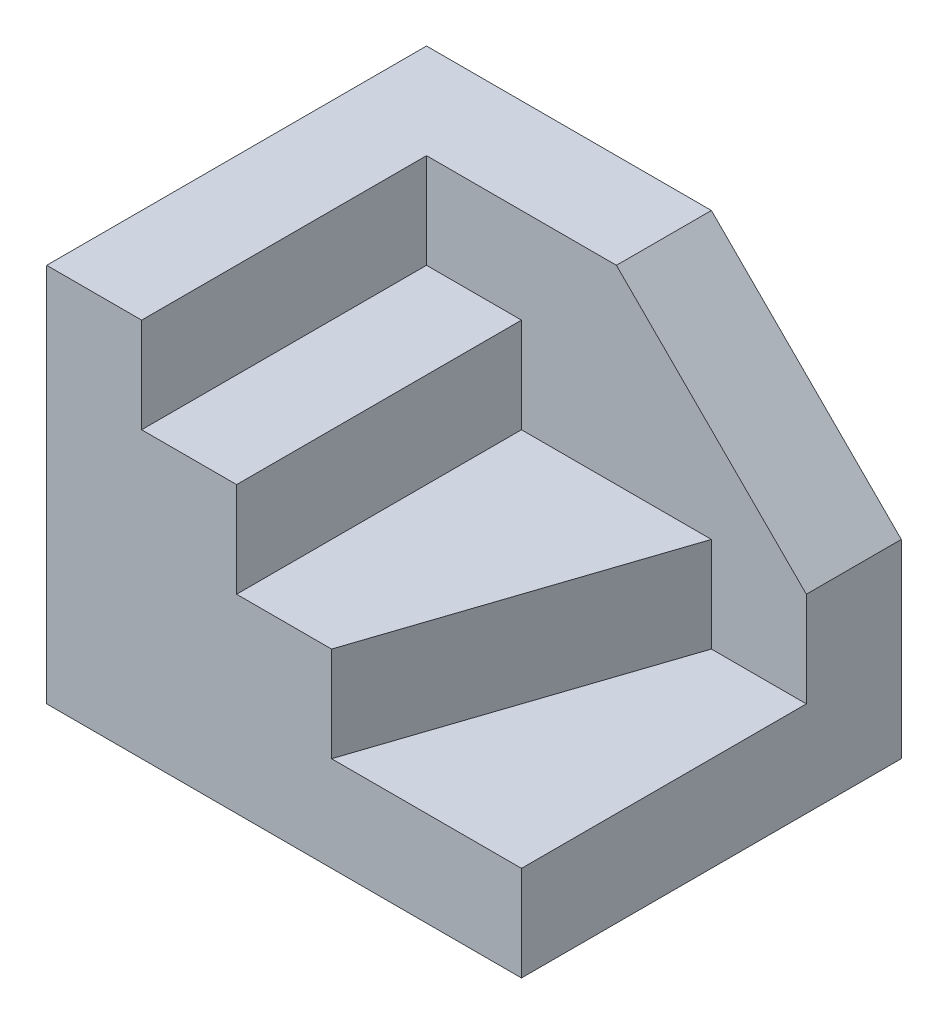
ISO-10303-21;
HEADER;
FILE_DESCRIPTION(('STEP AP214'),'2;1');
FILE_NAME('part.step','',(''),(''),'','','');
FILE_SCHEMA(('AUTOMOTIVE_DESIGN { 1 0 10303 214 1 1 1 1 }'));
ENDSEC;
DATA;
#1=APPLICATION_CONTEXT('core data for automotive mechanical design processes');
#2=APPLICATION_PROTOCOL_DEFINITION('international standard','automotive_design',2000,#1);
#3=PRODUCT_CONTEXT('',#1,'mechanical');
#4=PRODUCT('Part','Part','',(#3));
#5=PRODUCT_RELATED_PRODUCT_CATEGORY('part','',(#4));
#6=PRODUCT_DEFINITION_FORMATION('','',#4);
#7=PRODUCT_DEFINITION_CONTEXT('part definition',#1,'design');
#8=PRODUCT_DEFINITION('design','',#6,#7);
#9=PRODUCT_DEFINITION_SHAPE('','',#8);
#10=(LENGTH_UNIT() NAMED_UNIT(*) SI_UNIT(.MILLI.,.METRE.));
#11=(NAMED_UNIT(*) PLANE_ANGLE_UNIT() SI_UNIT($,.RADIAN.));
#12=(NAMED_UNIT(*) SI_UNIT($,.STERADIAN.) SOLID_ANGLE_UNIT());
#13=UNCERTAINTY_MEASURE_WITH_UNIT(LENGTH_MEASURE(1.E-05),#10,'distance_accuracy_value','');
#14=(GEOMETRIC_REPRESENTATION_CONTEXT(3) GLOBAL_UNCERTAINTY_ASSIGNED_CONTEXT((#13)) GLOBAL_UNIT_ASSIGNED_CONTEXT((#10,
#11,#12)) REPRESENTATION_CONTEXT('',''));
#15=CARTESIAN_POINT('',(0.,0.,0.));
#16=DIRECTION('',(0.,0.,1.));
#17=DIRECTION('',(1.,0.,0.));
#18=AXIS2_PLACEMENT_3D('',#15,#16,#17);
#19=CARTESIAN_POINT('',(0.,5.,0.));
#20=DIRECTION('',(0.,1.,0.));
#21=DIRECTION('',(0.,0.,1.));
#22=AXIS2_PLACEMENT_3D('',#19,#20,#21);
#23=PLANE('',#22);
#24=DIRECTION('',(1.,0.,0.));
#25=VECTOR('',#24,1.);
#26=CARTESIAN_POINT('',(0.,5.,-5.));
#27=LINE('',#26,#25);
#28=CARTESIAN_POINT('',(7.5,5.,-5.));
#29=VERTEX_POINT('',#28);
#30=CARTESIAN_POINT('',(12.5,5.,-5.));
#31=VERTEX_POINT('',#30);
#32=EDGE_CURVE('E156',#29,#31,#27,.T.);
#33=ORIENTED_EDGE('',*,*,#32,.F.);
#34=DIRECTION('',(0.316227766016838,0.,-0.948683298050514));
#35=VECTOR('',#34,1.);
#36=CARTESIAN_POINT('',(5.25,5.,1.75));
#37=LINE('',#36,#35);
#38=CARTESIAN_POINT('',(2.5,5.,10.));
#39=VERTEX_POINT('',#38);
#40=EDGE_CURVE('E114',#39,#29,#37,.T.);
#41=ORIENTED_EDGE('',*,*,#40,.F.);
#42=DIRECTION('',(-1.,0.,0.));
#43=VECTOR('',#42,1.);
#44=CARTESIAN_POINT('',(0.,5.,10.));
#45=LINE('',#44,#43);
#46=CARTESIAN_POINT('',(12.5,5.,10.));
#47=VERTEX_POINT('',#46);
#48=EDGE_CURVE('E101',#47,#39,#45,.T.);
#49=ORIENTED_EDGE('',*,*,#48,.F.);
#50=DIRECTION('',(0.,0.,-1.));
#51=VECTOR('',#50,1.);
#52=CARTESIAN_POINT('',(12.5,5.,0.));
#53=LINE('',#52,#51);
#54=EDGE_CURVE('E103',#47,#31,#53,.T.);
#55=ORIENTED_EDGE('',*,*,#54,.T.);
#56=EDGE_LOOP('',(#33,#41,#49,#55));
#57=FACE_BOUND('',#56,.T.);
#58=ADVANCED_FACE('F35',(#57),#23,.T.);
#59=CARTESIAN_POINT('',(0.,5.,10.));
#60=DIRECTION('',(0.,0.,1.));
#61=DIRECTION('',(1.,0.,0.));
#62=AXIS2_PLACEMENT_3D('',#59,#60,#61);
#63=PLANE('',#62);
#64=DIRECTION('',(-1.,0.,0.));
#65=VECTOR('',#64,1.);
#66=CARTESIAN_POINT('',(0.,20.,10.));
#67=LINE('',#66,#65);
#68=CARTESIAN_POINT('',(-7.5,20.,10.));
#69=VERTEX_POINT('',#68);
#70=CARTESIAN_POINT('',(-12.5,20.,10.));
#71=VERTEX_POINT('',#70);
#72=EDGE_CURVE('E167',#69,#71,#67,.T.);
#73=ORIENTED_EDGE('',*,*,#72,.T.);
#74=DIRECTION('',(0.,-1.,0.));
#75=VECTOR('',#74,1.);
#76=CARTESIAN_POINT('',(-12.5,5.,10.));
#77=LINE('',#76,#75);
#78=CARTESIAN_POINT('',(-12.5,0.,10.));
#79=VERTEX_POINT('',#78);
#80=EDGE_CURVE('E87',#71,#79,#77,.T.);
#81=ORIENTED_EDGE('',*,*,#80,.T.);
#82=DIRECTION('',(-1.,0.,0.));
#83=VECTOR('',#82,1.);
#84=CARTESIAN_POINT('',(0.,0.,10.));
#85=LINE('',#84,#83);
#86=CARTESIAN_POINT('',(12.5,0.,10.));
#87=VERTEX_POINT('',#86);
#88=EDGE_CURVE('E99',#87,#79,#85,.T.);
#89=ORIENTED_EDGE('',*,*,#88,.F.);
#90=DIRECTION('',(0.,-1.,0.));
#91=VECTOR('',#90,1.);
#92=CARTESIAN_POINT('',(12.5,5.,10.));
#93=LINE('',#92,#91);
#94=EDGE_CURVE('E43',#47,#87,#93,.T.);
#95=ORIENTED_EDGE('',*,*,#94,.F.);
#96=ORIENTED_EDGE('',*,*,#48,.T.);
#97=DIRECTION('',(0.,-1.,0.));
#98=VECTOR('',#97,1.);
#99=CARTESIAN_POINT('',(2.5,10.,10.));
#100=LINE('',#99,#98);
#101=CARTESIAN_POINT('',(2.5,10.,10.));
#102=VERTEX_POINT('',#101);
#103=EDGE_CURVE('E123',#102,#39,#100,.T.);
#104=ORIENTED_EDGE('',*,*,#103,.F.);
#105=DIRECTION('',(-1.,0.,0.));
#106=VECTOR('',#105,1.);
#107=CARTESIAN_POINT('',(0.,10.,10.));
#108=LINE('',#107,#106);
#109=CARTESIAN_POINT('',(-2.5,10.,10.));
#110=VERTEX_POINT('',#109);
#111=EDGE_CURVE('E126',#102,#110,#108,.T.);
#112=ORIENTED_EDGE('',*,*,#111,.T.);
#113=DIRECTION('',(0.,-1.,0.));
#114=VECTOR('',#113,1.);
#115=CARTESIAN_POINT('',(-2.5,15.,10.));
#116=LINE('',#115,#114);
#117=CARTESIAN_POINT('',(-2.5,15.,10.));
#118=VERTEX_POINT('',#117);
#119=EDGE_CURVE('E138',#118,#110,#116,.T.);
#120=ORIENTED_EDGE('',*,*,#119,.F.);
#121=DIRECTION('',(-1.,0.,0.));
#122=VECTOR('',#121,1.);
#123=CARTESIAN_POINT('',(0.,15.,10.));
#124=LINE('',#123,#122);
#125=CARTESIAN_POINT('',(-7.5,15.,10.));
#126=VERTEX_POINT('',#125);
#127=EDGE_CURVE('E153',#118,#126,#124,.T.);
#128=ORIENTED_EDGE('',*,*,#127,.T.);
#129=DIRECTION('',(0.,-1.,0.));
#130=VECTOR('',#129,1.);
#131=CARTESIAN_POINT('',(-7.5,20.,10.));
#132=LINE('',#131,#130);
#133=EDGE_CURVE('E164',#69,#126,#132,.T.);
#134=ORIENTED_EDGE('',*,*,#133,.F.);
#135=EDGE_LOOP('',(#73,#81,#89,#95,#96,#104,#112,#120,#128,#134));
#136=FACE_BOUND('',#135,.T.);
#137=ADVANCED_FACE('F37',(#136),#63,.T.);
#138=CARTESIAN_POINT('',(12.5,5.,0.));
#139=DIRECTION('',(-1.,0.,0.));
#140=DIRECTION('',(0.,0.,1.));
#141=AXIS2_PLACEMENT_3D('',#138,#139,#140);
#142=PLANE('',#141);
#143=DIRECTION('',(0.,-1.,0.));
#144=VECTOR('',#143,1.);
#145=CARTESIAN_POINT('',(12.5,5.,-10.));
#146=LINE('',#145,#144);
#147=CARTESIAN_POINT('',(12.5,10.,-10.));
#148=VERTEX_POINT('',#147);
#149=CARTESIAN_POINT('',(12.5,0.,-10.));
#150=VERTEX_POINT('',#149);
#151=EDGE_CURVE('E86',#148,#150,#146,.T.);
#152=ORIENTED_EDGE('',*,*,#151,.F.);
#153=DIRECTION('',(0.,0.,1.));
#154=VECTOR('',#153,1.);
#155=CARTESIAN_POINT('',(12.5,10.,-25.));
#156=LINE('',#155,#154);
#157=CARTESIAN_POINT('',(12.5,10.,-5.));
#158=VERTEX_POINT('',#157);
#159=EDGE_CURVE('E180',#148,#158,#156,.T.);
#160=ORIENTED_EDGE('',*,*,#159,.T.);
#161=DIRECTION('',(0.,-1.,0.));
#162=VECTOR('',#161,1.);
#163=CARTESIAN_POINT('',(12.5,20.,-5.));
#164=LINE('',#163,#162);
#165=EDGE_CURVE('E162',#158,#31,#164,.T.);
#166=ORIENTED_EDGE('',*,*,#165,.T.);
#167=ORIENTED_EDGE('',*,*,#54,.F.);
#168=ORIENTED_EDGE('',*,*,#94,.T.);
#169=DIRECTION('',(0.,0.,-1.));
#170=VECTOR('',#169,1.);
#171=CARTESIAN_POINT('',(12.5,0.,0.));
#172=LINE('',#171,#170);
#173=EDGE_CURVE('E96',#87,#150,#172,.T.);
#174=ORIENTED_EDGE('',*,*,#173,.T.);
#175=EDGE_LOOP('',(#152,#160,#166,#167,#168,#174));
#176=FACE_BOUND('',#175,.T.);
#177=ADVANCED_FACE('F109',(#176),#142,.F.);
#178=CARTESIAN_POINT('',(0.,5.,-10.));
#179=DIRECTION('',(0.,0.,1.));
#180=DIRECTION('',(1.,0.,0.));
#181=AXIS2_PLACEMENT_3D('',#178,#179,#180);
#182=PLANE('',#181);
#183=DIRECTION('',(-1.,0.,0.));
#184=VECTOR('',#183,1.);
#185=CARTESIAN_POINT('',(0.,20.,-10.));
#186=LINE('',#185,#184);
#187=CARTESIAN_POINT('',(2.5,20.,-10.));
#188=VERTEX_POINT('',#187);
#189=CARTESIAN_POINT('',(-12.5,20.,-10.));
#190=VERTEX_POINT('',#189);
#191=EDGE_CURVE('E170',#188,#190,#186,.T.);
#192=ORIENTED_EDGE('',*,*,#191,.F.);
#193=DIRECTION('',(0.707106781186548,-0.707106781186548,0.));
#194=VECTOR('',#193,1.);
#195=CARTESIAN_POINT('',(8.75,13.75,-10.));
#196=LINE('',#195,#194);
#197=EDGE_CURVE('E49',#188,#148,#196,.T.);
#198=ORIENTED_EDGE('',*,*,#197,.T.);
#199=ORIENTED_EDGE('',*,*,#151,.T.);
#200=DIRECTION('',(-1.,0.,0.));
#201=VECTOR('',#200,1.);
#202=CARTESIAN_POINT('',(0.,0.,-10.));
#203=LINE('',#202,#201);
#204=CARTESIAN_POINT('',(-12.5,0.,-10.));
#205=VERTEX_POINT('',#204);
#206=EDGE_CURVE('E90',#150,#205,#203,.T.);
#207=ORIENTED_EDGE('',*,*,#206,.T.);
#208=DIRECTION('',(0.,-1.,0.));
#209=VECTOR('',#208,1.);
#210=CARTESIAN_POINT('',(-12.5,5.,-10.));
#211=LINE('',#210,#209);
#212=EDGE_CURVE('E75',#190,#205,#211,.T.);
#213=ORIENTED_EDGE('',*,*,#212,.F.);
#214=EDGE_LOOP('',(#192,#198,#199,#207,#213));
#215=FACE_BOUND('',#214,.T.);
#216=ADVANCED_FACE('F91',(#215),#182,.F.);
#217=CARTESIAN_POINT('',(-12.5,5.,0.));
#218=DIRECTION('',(-1.,0.,0.));
#219=DIRECTION('',(0.,0.,1.));
#220=AXIS2_PLACEMENT_3D('',#217,#218,#219);
#221=PLANE('',#220);
#222=DIRECTION('',(0.,0.,-1.));
#223=VECTOR('',#222,1.);
#224=CARTESIAN_POINT('',(-12.5,0.,0.));
#225=LINE('',#224,#223);
#226=EDGE_CURVE('E80',#79,#205,#225,.T.);
#227=ORIENTED_EDGE('',*,*,#226,.F.);
#228=ORIENTED_EDGE('',*,*,#80,.F.);
#229=DIRECTION('',(0.,0.,-1.));
#230=VECTOR('',#229,1.);
#231=CARTESIAN_POINT('',(-12.5,20.,0.));
#232=LINE('',#231,#230);
#233=EDGE_CURVE('E83',#71,#190,#232,.T.);
#234=ORIENTED_EDGE('',*,*,#233,.T.);
#235=ORIENTED_EDGE('',*,*,#212,.T.);
#236=EDGE_LOOP('',(#227,#228,#234,#235));
#237=FACE_BOUND('',#236,.T.);
#238=ADVANCED_FACE('F77',(#237),#221,.T.);
#239=CARTESIAN_POINT('',(0.,0.,0.));
#240=DIRECTION('',(0.,1.,0.));
#241=DIRECTION('',(0.,0.,1.));
#242=AXIS2_PLACEMENT_3D('',#239,#240,#241);
#243=PLANE('',#242);
#244=ORIENTED_EDGE('',*,*,#88,.T.);
#245=ORIENTED_EDGE('',*,*,#226,.T.);
#246=ORIENTED_EDGE('',*,*,#206,.F.);
#247=ORIENTED_EDGE('',*,*,#173,.F.);
#248=EDGE_LOOP('',(#244,#245,#246,#247));
#249=FACE_BOUND('',#248,.T.);
#250=ADVANCED_FACE('F98',(#249),#243,.F.);
#251=CARTESIAN_POINT('',(5.25,10.,1.75));
#252=DIRECTION('',(0.948683298050514,0.,0.316227766016838));
#253=DIRECTION('',(0.316227766016838,0.,-0.948683298050514));
#254=AXIS2_PLACEMENT_3D('',#251,#252,#253);
#255=PLANE('',#254);
#256=ORIENTED_EDGE('',*,*,#103,.T.);
#257=ORIENTED_EDGE('',*,*,#40,.T.);
#258=DIRECTION('',(0.,-1.,0.));
#259=VECTOR('',#258,1.);
#260=CARTESIAN_POINT('',(7.5,10.,-5.));
#261=LINE('',#260,#259);
#262=CARTESIAN_POINT('',(7.5,10.,-5.));
#263=VERTEX_POINT('',#262);
#264=EDGE_CURVE('E117',#263,#29,#261,.T.);
#265=ORIENTED_EDGE('',*,*,#264,.F.);
#266=DIRECTION('',(-0.316227766016838,0.,0.948683298050514));
#267=VECTOR('',#266,1.);
#268=CARTESIAN_POINT('',(5.25,10.,1.75));
#269=LINE('',#268,#267);
#270=EDGE_CURVE('E135',#263,#102,#269,.T.);
#271=ORIENTED_EDGE('',*,*,#270,.T.);
#272=EDGE_LOOP('',(#256,#257,#265,#271));
#273=FACE_BOUND('',#272,.T.);
#274=ADVANCED_FACE('F260',(#273),#255,.T.);
#275=CARTESIAN_POINT('',(0.,10.,0.));
#276=DIRECTION('',(0.,1.,0.));
#277=DIRECTION('',(0.,0.,1.));
#278=AXIS2_PLACEMENT_3D('',#275,#276,#277);
#279=PLANE('',#278);
#280=ORIENTED_EDGE('',*,*,#270,.F.);
#281=DIRECTION('',(-1.,0.,0.));
#282=VECTOR('',#281,1.);
#283=CARTESIAN_POINT('',(0.,10.,-5.));
#284=LINE('',#283,#282);
#285=CARTESIAN_POINT('',(-2.5,10.,-5.));
#286=VERTEX_POINT('',#285);
#287=EDGE_CURVE('E132',#263,#286,#284,.T.);
#288=ORIENTED_EDGE('',*,*,#287,.T.);
#289=DIRECTION('',(0.,0.,-1.));
#290=VECTOR('',#289,1.);
#291=CARTESIAN_POINT('',(-2.5,10.,0.));
#292=LINE('',#291,#290);
#293=EDGE_CURVE('E129',#110,#286,#292,.T.);
#294=ORIENTED_EDGE('',*,*,#293,.F.);
#295=ORIENTED_EDGE('',*,*,#111,.F.);
#296=EDGE_LOOP('',(#280,#288,#294,#295));
#297=FACE_BOUND('',#296,.T.);
#298=ADVANCED_FACE('F250',(#297),#279,.T.);
#299=CARTESIAN_POINT('',(-2.5,15.,0.));
#300=DIRECTION('',(-1.,0.,0.));
#301=DIRECTION('',(0.,0.,1.));
#302=AXIS2_PLACEMENT_3D('',#299,#300,#301);
#303=PLANE('',#302);
#304=ORIENTED_EDGE('',*,*,#293,.T.);
#305=DIRECTION('',(0.,-1.,0.));
#306=VECTOR('',#305,1.);
#307=CARTESIAN_POINT('',(-2.5,15.,-5.));
#308=LINE('',#307,#306);
#309=CARTESIAN_POINT('',(-2.5,15.,-5.));
#310=VERTEX_POINT('',#309);
#311=EDGE_CURVE('E141',#310,#286,#308,.T.);
#312=ORIENTED_EDGE('',*,*,#311,.F.);
#313=DIRECTION('',(0.,0.,-1.));
#314=VECTOR('',#313,1.);
#315=CARTESIAN_POINT('',(-2.5,15.,0.));
#316=LINE('',#315,#314);
#317=EDGE_CURVE('E150',#118,#310,#316,.T.);
#318=ORIENTED_EDGE('',*,*,#317,.F.);
#319=ORIENTED_EDGE('',*,*,#119,.T.);
#320=EDGE_LOOP('',(#304,#312,#318,#319));
#321=FACE_BOUND('',#320,.T.);
#322=ADVANCED_FACE('F252',(#321),#303,.F.);
#323=CARTESIAN_POINT('',(0.,15.,0.));
#324=DIRECTION('',(0.,1.,0.));
#325=DIRECTION('',(0.,0.,1.));
#326=AXIS2_PLACEMENT_3D('',#323,#324,#325);
#327=PLANE('',#326);
#328=ORIENTED_EDGE('',*,*,#127,.F.);
#329=ORIENTED_EDGE('',*,*,#317,.T.);
#330=DIRECTION('',(-1.,0.,0.));
#331=VECTOR('',#330,1.);
#332=CARTESIAN_POINT('',(0.,15.,-5.));
#333=LINE('',#332,#331);
#334=CARTESIAN_POINT('',(-7.5,15.,-5.));
#335=VERTEX_POINT('',#334);
#336=EDGE_CURVE('E147',#310,#335,#333,.T.);
#337=ORIENTED_EDGE('',*,*,#336,.T.);
#338=DIRECTION('',(0.,0.,1.));
#339=VECTOR('',#338,1.);
#340=CARTESIAN_POINT('',(-7.5,15.,0.));
#341=LINE('',#340,#339);
#342=EDGE_CURVE('E144',#335,#126,#341,.T.);
#343=ORIENTED_EDGE('',*,*,#342,.T.);
#344=EDGE_LOOP('',(#328,#329,#337,#343));
#345=FACE_BOUND('',#344,.T.);
#346=ADVANCED_FACE('F244',(#345),#327,.T.);
#347=CARTESIAN_POINT('',(-7.5,20.,0.));
#348=DIRECTION('',(1.,0.,0.));
#349=DIRECTION('',(0.,0.,-1.));
#350=AXIS2_PLACEMENT_3D('',#347,#348,#349);
#351=PLANE('',#350);
#352=ORIENTED_EDGE('',*,*,#133,.T.);
#353=ORIENTED_EDGE('',*,*,#342,.F.);
#354=DIRECTION('',(0.,-1.,0.));
#355=VECTOR('',#354,1.);
#356=CARTESIAN_POINT('',(-7.5,20.,-5.));
#357=LINE('',#356,#355);
#358=CARTESIAN_POINT('',(-7.5,20.,-5.));
#359=VERTEX_POINT('',#358);
#360=EDGE_CURVE('E159',#359,#335,#357,.T.);
#361=ORIENTED_EDGE('',*,*,#360,.F.);
#362=DIRECTION('',(0.,0.,1.));
#363=VECTOR('',#362,1.);
#364=CARTESIAN_POINT('',(-7.5,20.,0.));
#365=LINE('',#364,#363);
#366=EDGE_CURVE('E176',#359,#69,#365,.T.);
#367=ORIENTED_EDGE('',*,*,#366,.T.);
#368=EDGE_LOOP('',(#352,#353,#361,#367));
#369=FACE_BOUND('',#368,.T.);
#370=ADVANCED_FACE('F239',(#369),#351,.T.);
#371=CARTESIAN_POINT('',(0.,20.,-5.));
#372=DIRECTION('',(0.,0.,1.));
#373=DIRECTION('',(1.,0.,0.));
#374=AXIS2_PLACEMENT_3D('',#371,#372,#373);
#375=PLANE('',#374);
#376=DIRECTION('',(0.707106781186548,-0.707106781186548,0.));
#377=VECTOR('',#376,1.);
#378=CARTESIAN_POINT('',(2.5,20.,-5.));
#379=LINE('',#378,#377);
#380=CARTESIAN_POINT('',(2.5,20.,-5.));
#381=VERTEX_POINT('',#380);
#382=EDGE_CURVE('E183',#381,#158,#379,.T.);
#383=ORIENTED_EDGE('',*,*,#382,.F.);
#384=DIRECTION('',(-1.,0.,0.));
#385=VECTOR('',#384,1.);
#386=CARTESIAN_POINT('',(0.,20.,-5.));
#387=LINE('',#386,#385);
#388=EDGE_CURVE('E173',#381,#359,#387,.T.);
#389=ORIENTED_EDGE('',*,*,#388,.T.);
#390=ORIENTED_EDGE('',*,*,#360,.T.);
#391=ORIENTED_EDGE('',*,*,#336,.F.);
#392=ORIENTED_EDGE('',*,*,#311,.T.);
#393=ORIENTED_EDGE('',*,*,#287,.F.);
#394=ORIENTED_EDGE('',*,*,#264,.T.);
#395=ORIENTED_EDGE('',*,*,#32,.T.);
#396=ORIENTED_EDGE('',*,*,#165,.F.);
#397=EDGE_LOOP('',(#383,#389,#390,#391,#392,#393,#394,#395,#396));
#398=FACE_BOUND('',#397,.T.);
#399=ADVANCED_FACE('F195',(#398),#375,.T.);
#400=CARTESIAN_POINT('',(0.,20.,0.));
#401=DIRECTION('',(0.,1.,0.));
#402=DIRECTION('',(0.,0.,1.));
#403=AXIS2_PLACEMENT_3D('',#400,#401,#402);
#404=PLANE('',#403);
#405=DIRECTION('',(0.,0.,1.));
#406=VECTOR('',#405,1.);
#407=CARTESIAN_POINT('',(2.5,20.,0.));
#408=LINE('',#407,#406);
#409=EDGE_CURVE('E11',#188,#381,#408,.T.);
#410=ORIENTED_EDGE('',*,*,#409,.F.);
#411=ORIENTED_EDGE('',*,*,#191,.T.);
#412=ORIENTED_EDGE('',*,*,#233,.F.);
#413=ORIENTED_EDGE('',*,*,#72,.F.);
#414=ORIENTED_EDGE('',*,*,#366,.F.);
#415=ORIENTED_EDGE('',*,*,#388,.F.);
#416=EDGE_LOOP('',(#410,#411,#412,#413,#414,#415));
#417=FACE_BOUND('',#416,.T.);
#418=ADVANCED_FACE('F241',(#417),#404,.T.);
#419=CARTESIAN_POINT('',(2.5,20.,-25.));
#420=DIRECTION('',(-0.707106781186548,-0.707106781186548,0.));
#421=DIRECTION('',(0.707106781186548,-0.707106781186548,0.));
#422=AXIS2_PLACEMENT_3D('',#419,#420,#421);
#423=PLANE('',#422);
#424=ORIENTED_EDGE('',*,*,#409,.T.);
#425=ORIENTED_EDGE('',*,*,#382,.T.);
#426=ORIENTED_EDGE('',*,*,#159,.F.);
#427=ORIENTED_EDGE('',*,*,#197,.F.);
#428=EDGE_LOOP('',(#424,#425,#426,#427));
#429=FACE_BOUND('',#428,.T.);
#430=ADVANCED_FACE('F187',(#429),#423,.F.);
#431=CLOSED_SHELL('',(#58,#137,#177,#216,#238,#250,#274,#298,#322,#346,#370,#399,#418,#430));
#432=MANIFOLD_SOLID_BREP('B2',#431);
#433=ADVANCED_BREP_SHAPE_REPRESENTATION('',(#18,#432),#14);
#434=SHAPE_DEFINITION_REPRESENTATION(#9,#433);
ENDSEC;
END-ISO-10303-21;
